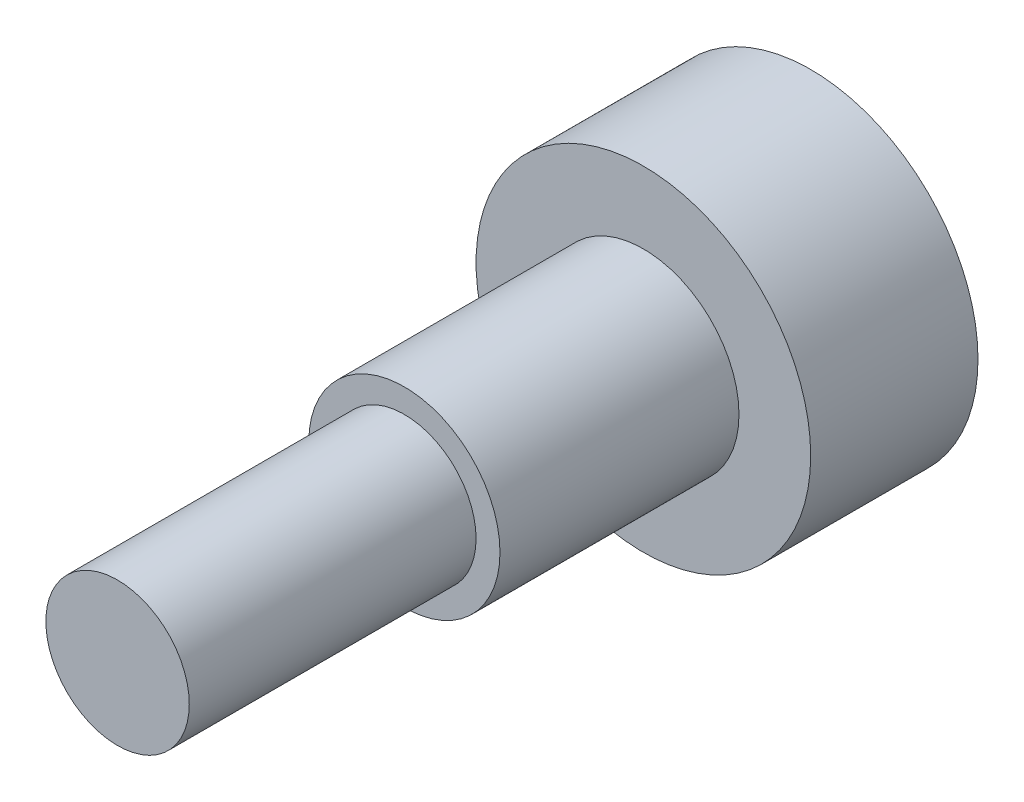
ISO-10303-21;
HEADER;
FILE_DESCRIPTION(('STEP AP214'),'2;1');
FILE_NAME('part.step','',(''),(''),'','','');
FILE_SCHEMA(('AUTOMOTIVE_DESIGN { 1 0 10303 214 1 1 1 1 }'));
ENDSEC;
DATA;
#1=APPLICATION_CONTEXT('core data for automotive mechanical design processes');
#2=APPLICATION_PROTOCOL_DEFINITION('international standard','automotive_design',2000,#1);
#3=PRODUCT_CONTEXT('',#1,'mechanical');
#4=PRODUCT('Part','Part','',(#3));
#5=PRODUCT_RELATED_PRODUCT_CATEGORY('part','',(#4));
#6=PRODUCT_DEFINITION_FORMATION('','',#4);
#7=PRODUCT_DEFINITION_CONTEXT('part definition',#1,'design');
#8=PRODUCT_DEFINITION('design','',#6,#7);
#9=PRODUCT_DEFINITION_SHAPE('','',#8);
#10=(LENGTH_UNIT() NAMED_UNIT(*) SI_UNIT(.MILLI.,.METRE.));
#11=(NAMED_UNIT(*) PLANE_ANGLE_UNIT() SI_UNIT($,.RADIAN.));
#12=(NAMED_UNIT(*) SI_UNIT($,.STERADIAN.) SOLID_ANGLE_UNIT());
#13=UNCERTAINTY_MEASURE_WITH_UNIT(LENGTH_MEASURE(1.E-05),#10,'distance_accuracy_value','');
#14=(GEOMETRIC_REPRESENTATION_CONTEXT(3) GLOBAL_UNCERTAINTY_ASSIGNED_CONTEXT((#13)) GLOBAL_UNIT_ASSIGNED_CONTEXT((#10,
#11,#12)) REPRESENTATION_CONTEXT('',''));
#15=CARTESIAN_POINT('',(0.,0.,0.));
#16=DIRECTION('',(0.,0.,1.));
#17=DIRECTION('',(1.,0.,0.));
#18=AXIS2_PLACEMENT_3D('',#15,#16,#17);
#19=CARTESIAN_POINT('',(0.,0.,3.5));
#20=DIRECTION('',(0.,0.,-1.));
#21=DIRECTION('',(-1.,0.,0.));
#22=AXIS2_PLACEMENT_3D('',#19,#20,#21);
#23=CYLINDRICAL_SURFACE('',#22,3.5);
#24=CARTESIAN_POINT('',(0.,0.,3.5));
#25=DIRECTION('',(0.,0.,1.));
#26=DIRECTION('',(1.,0.,0.));
#27=AXIS2_PLACEMENT_3D('',#24,#25,#26);
#28=CIRCLE('',#27,3.5);
#29=CARTESIAN_POINT('',(3.5,0.,3.5));
#30=VERTEX_POINT('',#29);
#31=EDGE_CURVE('E51',#30,#30,#28,.T.);
#32=ORIENTED_EDGE('',*,*,#31,.F.);
#33=EDGE_LOOP('',(#32));
#34=FACE_BOUND('',#33,.T.);
#35=CARTESIAN_POINT('',(0.,0.,0.));
#36=DIRECTION('',(0.,0.,1.));
#37=DIRECTION('',(1.,0.,0.));
#38=AXIS2_PLACEMENT_3D('',#35,#36,#37);
#39=CIRCLE('',#38,3.5);
#40=CARTESIAN_POINT('',(3.5,0.,0.));
#41=VERTEX_POINT('',#40);
#42=EDGE_CURVE('E40',#41,#41,#39,.T.);
#43=ORIENTED_EDGE('',*,*,#42,.T.);
#44=EDGE_LOOP('',(#43));
#45=FACE_BOUND('',#44,.T.);
#46=ADVANCED_FACE('F37',(#34,#45),#23,.T.);
#47=CARTESIAN_POINT('',(0.,0.,3.5));
#48=DIRECTION('',(0.,0.,1.));
#49=DIRECTION('',(1.,0.,0.));
#50=AXIS2_PLACEMENT_3D('',#47,#48,#49);
#51=PLANE('',#50);
#52=CARTESIAN_POINT('',(0.,0.,3.5));
#53=DIRECTION('',(0.,0.,1.));
#54=DIRECTION('',(1.,0.,0.));
#55=AXIS2_PLACEMENT_3D('',#52,#53,#54);
#56=CIRCLE('',#55,2.);
#57=CARTESIAN_POINT('',(2.,0.,3.5));
#58=VERTEX_POINT('',#57);
#59=EDGE_CURVE('E45',#58,#58,#56,.T.);
#60=ORIENTED_EDGE('',*,*,#59,.F.);
#61=EDGE_LOOP('',(#60));
#62=FACE_BOUND('',#61,.T.);
#63=ORIENTED_EDGE('',*,*,#31,.T.);
#64=EDGE_LOOP('',(#63));
#65=FACE_BOUND('',#64,.T.);
#66=ADVANCED_FACE('F71',(#62,#65),#51,.T.);
#67=CARTESIAN_POINT('',(0.,0.,0.));
#68=DIRECTION('',(0.,0.,1.));
#69=DIRECTION('',(1.,0.,0.));
#70=AXIS2_PLACEMENT_3D('',#67,#68,#69);
#71=PLANE('',#70);
#72=ORIENTED_EDGE('',*,*,#42,.F.);
#73=EDGE_LOOP('',(#72));
#74=FACE_BOUND('',#73,.T.);
#75=ADVANCED_FACE('F68',(#74),#71,.F.);
#76=CARTESIAN_POINT('',(0.,0.,8.5));
#77=DIRECTION('',(0.,0.,-1.));
#78=DIRECTION('',(-1.,0.,0.));
#79=AXIS2_PLACEMENT_3D('',#76,#77,#78);
#80=CYLINDRICAL_SURFACE('',#79,2.);
#81=CARTESIAN_POINT('',(0.,0.,8.5));
#82=DIRECTION('',(0.,0.,1.));
#83=DIRECTION('',(1.,0.,0.));
#84=AXIS2_PLACEMENT_3D('',#81,#82,#83);
#85=CIRCLE('',#84,2.);
#86=CARTESIAN_POINT('',(2.,0.,8.5));
#87=VERTEX_POINT('',#86);
#88=EDGE_CURVE('E56',#87,#87,#85,.T.);
#89=ORIENTED_EDGE('',*,*,#88,.F.);
#90=EDGE_LOOP('',(#89));
#91=FACE_BOUND('',#90,.T.);
#92=ORIENTED_EDGE('',*,*,#59,.T.);
#93=EDGE_LOOP('',(#92));
#94=FACE_BOUND('',#93,.T.);
#95=ADVANCED_FACE('F70',(#91,#94),#80,.T.);
#96=CARTESIAN_POINT('',(0.,0.,8.5));
#97=DIRECTION('',(0.,0.,1.));
#98=DIRECTION('',(1.,0.,0.));
#99=AXIS2_PLACEMENT_3D('',#96,#97,#98);
#100=PLANE('',#99);
#101=CARTESIAN_POINT('',(0.,0.,8.5));
#102=DIRECTION('',(0.,0.,1.));
#103=DIRECTION('',(1.,0.,0.));
#104=AXIS2_PLACEMENT_3D('',#101,#102,#103);
#105=CIRCLE('',#104,1.5);
#106=CARTESIAN_POINT('',(1.5,0.,8.5));
#107=VERTEX_POINT('',#106);
#108=EDGE_CURVE('E10',#107,#107,#105,.T.);
#109=ORIENTED_EDGE('',*,*,#108,.F.);
#110=EDGE_LOOP('',(#109));
#111=FACE_BOUND('',#110,.T.);
#112=ORIENTED_EDGE('',*,*,#88,.T.);
#113=EDGE_LOOP('',(#112));
#114=FACE_BOUND('',#113,.T.);
#115=ADVANCED_FACE('F76',(#111,#114),#100,.T.);
#116=CARTESIAN_POINT('',(0.,0.,14.5));
#117=DIRECTION('',(0.,0.,-1.));
#118=DIRECTION('',(-1.,0.,0.));
#119=AXIS2_PLACEMENT_3D('',#116,#117,#118);
#120=CYLINDRICAL_SURFACE('',#119,1.5);
#121=CARTESIAN_POINT('',(0.,0.,14.5));
#122=DIRECTION('',(0.,0.,1.));
#123=DIRECTION('',(1.,0.,0.));
#124=AXIS2_PLACEMENT_3D('',#121,#122,#123);
#125=CIRCLE('',#124,1.5);
#126=CARTESIAN_POINT('',(1.5,0.,14.5));
#127=VERTEX_POINT('',#126);
#128=EDGE_CURVE('E55',#127,#127,#125,.T.);
#129=ORIENTED_EDGE('',*,*,#128,.F.);
#130=EDGE_LOOP('',(#129));
#131=FACE_BOUND('',#130,.T.);
#132=ORIENTED_EDGE('',*,*,#108,.T.);
#133=EDGE_LOOP('',(#132));
#134=FACE_BOUND('',#133,.T.);
#135=ADVANCED_FACE('F106',(#131,#134),#120,.T.);
#136=CARTESIAN_POINT('',(0.,0.,14.5));
#137=DIRECTION('',(0.,0.,1.));
#138=DIRECTION('',(1.,0.,0.));
#139=AXIS2_PLACEMENT_3D('',#136,#137,#138);
#140=PLANE('',#139);
#141=ORIENTED_EDGE('',*,*,#128,.T.);
#142=EDGE_LOOP('',(#141));
#143=FACE_BOUND('',#142,.T.);
#144=ADVANCED_FACE('F116',(#143),#140,.T.);
#145=CLOSED_SHELL('',(#46,#66,#75,#95,#115,#135,#144));
#146=MANIFOLD_SOLID_BREP('B2',#145);
#147=ADVANCED_BREP_SHAPE_REPRESENTATION('',(#18,#146),#14);
#148=SHAPE_DEFINITION_REPRESENTATION(#9,#147);
ENDSEC;
END-ISO-10303-21;
